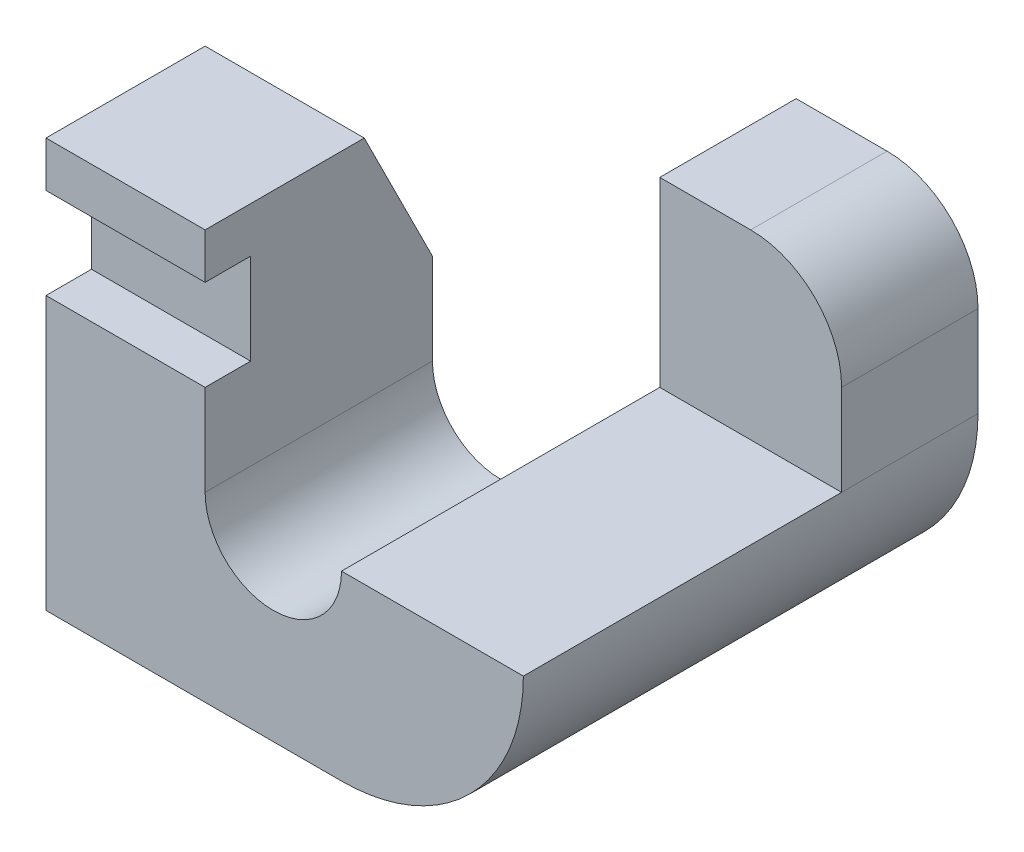
ISO-10303-21;
HEADER;
FILE_DESCRIPTION(('STEP AP214'),'2;1');
FILE_NAME('part.step','',(''),(''),'','','');
FILE_SCHEMA(('AUTOMOTIVE_DESIGN { 1 0 10303 214 1 1 1 1 }'));
ENDSEC;
DATA;
#1=APPLICATION_CONTEXT('core data for automotive mechanical design processes');
#2=APPLICATION_PROTOCOL_DEFINITION('international standard','automotive_design',2000,#1);
#3=PRODUCT_CONTEXT('',#1,'mechanical');
#4=PRODUCT('Part','Part','',(#3));
#5=PRODUCT_RELATED_PRODUCT_CATEGORY('part','',(#4));
#6=PRODUCT_DEFINITION_FORMATION('','',#4);
#7=PRODUCT_DEFINITION_CONTEXT('part definition',#1,'design');
#8=PRODUCT_DEFINITION('design','',#6,#7);
#9=PRODUCT_DEFINITION_SHAPE('','',#8);
#10=(LENGTH_UNIT() NAMED_UNIT(*) SI_UNIT(.MILLI.,.METRE.));
#11=(NAMED_UNIT(*) PLANE_ANGLE_UNIT() SI_UNIT($,.RADIAN.));
#12=(NAMED_UNIT(*) SI_UNIT($,.STERADIAN.) SOLID_ANGLE_UNIT());
#13=UNCERTAINTY_MEASURE_WITH_UNIT(LENGTH_MEASURE(1.E-05),#10,'distance_accuracy_value','');
#14=(GEOMETRIC_REPRESENTATION_CONTEXT(3) GLOBAL_UNCERTAINTY_ASSIGNED_CONTEXT((#13)) GLOBAL_UNIT_ASSIGNED_CONTEXT((#10,
#11,#12)) REPRESENTATION_CONTEXT('',''));
#15=CARTESIAN_POINT('',(0.,0.,0.));
#16=DIRECTION('',(0.,0.,1.));
#17=DIRECTION('',(1.,0.,0.));
#18=AXIS2_PLACEMENT_3D('',#15,#16,#17);
#19=CARTESIAN_POINT('',(-12.0347777082568,-10.3653005489695,80.));
#20=DIRECTION('',(0.,0.,1.));
#21=DIRECTION('',(1.,0.,0.));
#22=AXIS2_PLACEMENT_3D('',#19,#20,#21);
#23=PLANE('',#22);
#24=DIRECTION('',(-1.,0.,0.));
#25=VECTOR('',#24,1.);
#26=CARTESIAN_POINT('',(-12.0347777082568,21.6346994510305,80.));
#27=LINE('',#26,#25);
#28=CARTESIAN_POINT('',(-36.0347777082568,21.6346994510305,80.));
#29=VERTEX_POINT('',#28);
#30=CARTESIAN_POINT('',(-64.0347777082568,21.6346994510305,80.));
#31=VERTEX_POINT('',#30);
#32=EDGE_CURVE('E44',#29,#31,#27,.T.);
#33=ORIENTED_EDGE('',*,*,#32,.F.);
#34=DIRECTION('',(0.,1.,0.));
#35=VECTOR('',#34,1.);
#36=CARTESIAN_POINT('',(-36.0347777082568,29.6346994510305,80.));
#37=LINE('',#36,#35);
#38=CARTESIAN_POINT('',(-36.0347777082568,29.6346994510305,80.));
#39=VERTEX_POINT('',#38);
#40=EDGE_CURVE('E175',#29,#39,#37,.T.);
#41=ORIENTED_EDGE('',*,*,#40,.T.);
#42=DIRECTION('',(-1.,0.,0.));
#43=VECTOR('',#42,1.);
#44=CARTESIAN_POINT('',(-64.0347777082568,29.6346994510305,80.));
#45=LINE('',#44,#43);
#46=CARTESIAN_POINT('',(-64.0347777082568,29.6346994510305,80.));
#47=VERTEX_POINT('',#46);
#48=EDGE_CURVE('E174',#39,#47,#45,.T.);
#49=ORIENTED_EDGE('',*,*,#48,.T.);
#50=DIRECTION('',(0.,-1.,0.));
#51=VECTOR('',#50,1.);
#52=CARTESIAN_POINT('',(-64.0347777082568,29.6346994510305,80.));
#53=LINE('',#52,#51);
#54=EDGE_CURVE('E238',#47,#31,#53,.T.);
#55=ORIENTED_EDGE('',*,*,#54,.T.);
#56=EDGE_LOOP('',(#33,#41,#49,#55));
#57=FACE_BOUND('',#56,.T.);
#58=ADVANCED_FACE('F36',(#57),#23,.T.);
#59=CARTESIAN_POINT('',(-64.0347777082568,29.6346994510305,80.));
#60=DIRECTION('',(1.,0.,0.));
#61=DIRECTION('',(0.,1.,0.));
#62=AXIS2_PLACEMENT_3D('',#59,#60,#61);
#63=PLANE('',#62);
#64=DIRECTION('',(0.,1.,0.));
#65=VECTOR('',#64,1.);
#66=CARTESIAN_POINT('',(-64.0347777082568,29.6346994510305,72.));
#67=LINE('',#66,#65);
#68=CARTESIAN_POINT('',(-64.0347777082568,5.63469945103048,72.));
#69=VERTEX_POINT('',#68);
#70=CARTESIAN_POINT('',(-64.0347777082568,21.6346994510305,72.));
#71=VERTEX_POINT('',#70);
#72=EDGE_CURVE('E239',#69,#71,#67,.T.);
#73=ORIENTED_EDGE('',*,*,#72,.T.);
#74=DIRECTION('',(0.,0.,1.));
#75=VECTOR('',#74,1.);
#76=CARTESIAN_POINT('',(-64.0347777082568,21.6346994510305,80.));
#77=LINE('',#76,#75);
#78=EDGE_CURVE('E230',#71,#31,#77,.T.);
#79=ORIENTED_EDGE('',*,*,#78,.T.);
#80=ORIENTED_EDGE('',*,*,#54,.F.);
#81=DIRECTION('',(0.,0.,-1.));
#82=VECTOR('',#81,1.);
#83=CARTESIAN_POINT('',(-64.0347777082568,29.6346994510305,80.));
#84=LINE('',#83,#82);
#85=CARTESIAN_POINT('',(-64.0347777082568,29.6346994510305,52.));
#86=VERTEX_POINT('',#85);
#87=EDGE_CURVE('E177',#47,#86,#84,.T.);
#88=ORIENTED_EDGE('',*,*,#87,.T.);
#89=DIRECTION('',(0.,-0.894427190999916,-0.447213595499958));
#90=VECTOR('',#89,1.);
#91=CARTESIAN_POINT('',(-64.0347777082568,40.8346994510305,57.6));
#92=LINE('',#91,#90);
#93=CARTESIAN_POINT('',(-64.0347777082568,5.63469945103048,40.));
#94=VERTEX_POINT('',#93);
#95=EDGE_CURVE('E322',#86,#94,#92,.T.);
#96=ORIENTED_EDGE('',*,*,#95,.T.);
#97=DIRECTION('',(0.,1.,0.));
#98=VECTOR('',#97,1.);
#99=CARTESIAN_POINT('',(-64.0347777082568,-70.3653005489695,40.));
#100=LINE('',#99,#98);
#101=CARTESIAN_POINT('',(-64.0347777082568,-42.3653005489695,40.));
#102=VERTEX_POINT('',#101);
#103=EDGE_CURVE('E307',#102,#94,#100,.T.);
#104=ORIENTED_EDGE('',*,*,#103,.F.);
#105=DIRECTION('',(0.,0.,-1.));
#106=VECTOR('',#105,1.);
#107=CARTESIAN_POINT('',(-64.0347777082568,-42.3653005489695,80.));
#108=LINE('',#107,#106);
#109=CARTESIAN_POINT('',(-64.0347777082568,-42.3653005489695,80.));
#110=VERTEX_POINT('',#109);
#111=EDGE_CURVE('E222',#110,#102,#108,.T.);
#112=ORIENTED_EDGE('',*,*,#111,.F.);
#113=CARTESIAN_POINT('',(-64.0347777082568,5.63469945103048,80.));
#114=VERTEX_POINT('',#113);
#115=EDGE_CURVE('E197',#114,#110,#53,.T.);
#116=ORIENTED_EDGE('',*,*,#115,.F.);
#117=DIRECTION('',(0.,0.,-1.));
#118=VECTOR('',#117,1.);
#119=CARTESIAN_POINT('',(-64.0347777082568,5.63469945103048,80.));
#120=LINE('',#119,#118);
#121=EDGE_CURVE('E51',#114,#69,#120,.T.);
#122=ORIENTED_EDGE('',*,*,#121,.T.);
#123=EDGE_LOOP('',(#73,#79,#80,#88,#96,#104,#112,#116,#122));
#124=FACE_BOUND('',#123,.T.);
#125=ADVANCED_FACE('F38',(#124),#63,.F.);
#126=CARTESIAN_POINT('',(-64.0347777082568,-42.3653005489695,80.));
#127=DIRECTION('',(0.,1.,0.));
#128=DIRECTION('',(0.,0.,1.));
#129=AXIS2_PLACEMENT_3D('',#126,#127,#128);
#130=PLANE('',#129);
#131=ORIENTED_EDGE('',*,*,#111,.T.);
#132=DIRECTION('',(1.,0.,0.));
#133=VECTOR('',#132,1.);
#134=CARTESIAN_POINT('',(-64.0347777082568,-42.3653005489695,40.));
#135=LINE('',#134,#133);
#136=CARTESIAN_POINT('',(-12.0347777082568,-42.3653005489695,40.));
#137=VERTEX_POINT('',#136);
#138=EDGE_CURVE('E272',#102,#137,#135,.T.);
#139=ORIENTED_EDGE('',*,*,#138,.T.);
#140=DIRECTION('',(0.,0.,-1.));
#141=VECTOR('',#140,1.);
#142=CARTESIAN_POINT('',(-12.0347777082568,-42.3653005489695,80.));
#143=LINE('',#142,#141);
#144=CARTESIAN_POINT('',(-12.0347777082568,-42.3653005489695,80.));
#145=VERTEX_POINT('',#144);
#146=EDGE_CURVE('E219',#145,#137,#143,.T.);
#147=ORIENTED_EDGE('',*,*,#146,.F.);
#148=DIRECTION('',(1.,0.,0.));
#149=VECTOR('',#148,1.);
#150=CARTESIAN_POINT('',(-64.0347777082568,-42.3653005489695,80.));
#151=LINE('',#150,#149);
#152=EDGE_CURVE('E243',#110,#145,#151,.T.);
#153=ORIENTED_EDGE('',*,*,#152,.F.);
#154=EDGE_LOOP('',(#131,#139,#147,#153));
#155=FACE_BOUND('',#154,.T.);
#156=ADVANCED_FACE('F351',(#155),#130,.F.);
#157=CARTESIAN_POINT('',(-12.0347777082568,-10.3653005489695,80.));
#158=DIRECTION('',(0.,0.,-1.));
#159=DIRECTION('',(-1.,0.,0.));
#160=AXIS2_PLACEMENT_3D('',#157,#158,#159);
#161=CYLINDRICAL_SURFACE('',#160,32.);
#162=CARTESIAN_POINT('',(-12.0347777082568,-10.3653005489695,0.));
#163=DIRECTION('',(0.,0.,1.));
#164=DIRECTION('',(1.,0.,0.));
#165=AXIS2_PLACEMENT_3D('',#162,#163,#164);
#166=CIRCLE('',#165,32.);
#167=CARTESIAN_POINT('',(-12.0347777082568,-42.3653005489695,0.));
#168=VERTEX_POINT('',#167);
#169=CARTESIAN_POINT('',(19.9652222917432,-10.3653005489695,0.));
#170=VERTEX_POINT('',#169);
#171=EDGE_CURVE('E182',#168,#170,#166,.T.);
#172=ORIENTED_EDGE('',*,*,#171,.T.);
#173=DIRECTION('',(0.,0.,-1.));
#174=VECTOR('',#173,1.);
#175=CARTESIAN_POINT('',(19.9652222917432,-10.3653005489695,80.));
#176=LINE('',#175,#174);
#177=CARTESIAN_POINT('',(19.9652222917432,-10.3653005489695,24.));
#178=VERTEX_POINT('',#177);
#179=EDGE_CURVE('E215',#178,#170,#176,.T.);
#180=ORIENTED_EDGE('',*,*,#179,.F.);
#181=CARTESIAN_POINT('',(19.9652222917432,-10.3653005489695,80.));
#182=VERTEX_POINT('',#181);
#183=EDGE_CURVE('E216',#182,#178,#176,.T.);
#184=ORIENTED_EDGE('',*,*,#183,.F.);
#185=CARTESIAN_POINT('',(-12.0347777082568,-10.3653005489695,80.));
#186=DIRECTION('',(0.,0.,1.));
#187=DIRECTION('',(1.,0.,0.));
#188=AXIS2_PLACEMENT_3D('',#185,#186,#187);
#189=CIRCLE('',#188,32.);
#190=EDGE_CURVE('E245',#145,#182,#189,.T.);
#191=ORIENTED_EDGE('',*,*,#190,.F.);
#192=ORIENTED_EDGE('',*,*,#146,.T.);
#193=DIRECTION('',(0.,0.,-1.));
#194=VECTOR('',#193,1.);
#195=CARTESIAN_POINT('',(-12.0347777082568,-42.3653005489695,80.));
#196=LINE('',#195,#194);
#197=EDGE_CURVE('E300',#137,#168,#196,.T.);
#198=ORIENTED_EDGE('',*,*,#197,.T.);
#199=EDGE_LOOP('',(#172,#180,#184,#191,#192,#198));
#200=FACE_BOUND('',#199,.T.);
#201=ADVANCED_FACE('F257',(#200),#161,.T.);
#202=CARTESIAN_POINT('',(19.9652222917432,-10.3653005489695,80.));
#203=DIRECTION('',(-1.,0.,0.));
#204=DIRECTION('',(0.,0.,1.));
#205=AXIS2_PLACEMENT_3D('',#202,#203,#204);
#206=PLANE('',#205);
#207=DIRECTION('',(0.,0.,-1.));
#208=VECTOR('',#207,1.);
#209=CARTESIAN_POINT('',(19.9652222917432,5.63469945103048,80.));
#210=LINE('',#209,#208);
#211=CARTESIAN_POINT('',(19.9652222917432,5.63469945103048,24.));
#212=VERTEX_POINT('',#211);
#213=CARTESIAN_POINT('',(19.9652222917432,5.63469945103048,0.));
#214=VERTEX_POINT('',#213);
#215=EDGE_CURVE('E213',#212,#214,#210,.T.);
#216=ORIENTED_EDGE('',*,*,#215,.F.);
#217=DIRECTION('',(0.,1.,0.));
#218=VECTOR('',#217,1.);
#219=CARTESIAN_POINT('',(19.9652222917432,-10.3653005489695,24.));
#220=LINE('',#219,#218);
#221=EDGE_CURVE('E267',#178,#212,#220,.T.);
#222=ORIENTED_EDGE('',*,*,#221,.F.);
#223=ORIENTED_EDGE('',*,*,#179,.T.);
#224=DIRECTION('',(0.,1.,0.));
#225=VECTOR('',#224,1.);
#226=CARTESIAN_POINT('',(19.9652222917432,-10.3653005489695,0.));
#227=LINE('',#226,#225);
#228=EDGE_CURVE('E185',#170,#214,#227,.T.);
#229=ORIENTED_EDGE('',*,*,#228,.T.);
#230=EDGE_LOOP('',(#216,#222,#223,#229));
#231=FACE_BOUND('',#230,.T.);
#232=ADVANCED_FACE('F268',(#231),#206,.F.);
#233=CARTESIAN_POINT('',(3.96522229174322,5.63469945103048,80.));
#234=DIRECTION('',(0.,0.,-1.));
#235=DIRECTION('',(-1.,0.,0.));
#236=AXIS2_PLACEMENT_3D('',#233,#234,#235);
#237=CYLINDRICAL_SURFACE('',#236,16.);
#238=DIRECTION('',(0.,0.,-1.));
#239=VECTOR('',#238,1.);
#240=CARTESIAN_POINT('',(3.96522229174322,21.6346994510305,80.));
#241=LINE('',#240,#239);
#242=CARTESIAN_POINT('',(3.96522229174322,21.6346994510305,24.));
#243=VERTEX_POINT('',#242);
#244=CARTESIAN_POINT('',(3.96522229174322,21.6346994510305,0.));
#245=VERTEX_POINT('',#244);
#246=EDGE_CURVE('E211',#243,#245,#241,.T.);
#247=ORIENTED_EDGE('',*,*,#246,.F.);
#248=CARTESIAN_POINT('',(3.96522229174322,5.63469945103048,24.));
#249=DIRECTION('',(0.,0.,-1.));
#250=DIRECTION('',(-1.,0.,0.));
#251=AXIS2_PLACEMENT_3D('',#248,#249,#250);
#252=CIRCLE('',#251,16.);
#253=EDGE_CURVE('E186',#243,#212,#252,.T.);
#254=ORIENTED_EDGE('',*,*,#253,.T.);
#255=ORIENTED_EDGE('',*,*,#215,.T.);
#256=CARTESIAN_POINT('',(3.96522229174322,5.63469945103048,0.));
#257=DIRECTION('',(0.,0.,1.));
#258=DIRECTION('',(-1.,0.,0.));
#259=AXIS2_PLACEMENT_3D('',#256,#257,#258);
#260=CIRCLE('',#259,16.);
#261=EDGE_CURVE('E189',#214,#245,#260,.T.);
#262=ORIENTED_EDGE('',*,*,#261,.T.);
#263=EDGE_LOOP('',(#247,#254,#255,#262));
#264=FACE_BOUND('',#263,.T.);
#265=ADVANCED_FACE('F287',(#264),#237,.T.);
#266=CARTESIAN_POINT('',(-12.0347777082568,21.6346994510305,80.));
#267=DIRECTION('',(0.,-1.,0.));
#268=DIRECTION('',(0.,0.,-1.));
#269=AXIS2_PLACEMENT_3D('',#266,#267,#268);
#270=PLANE('',#269);
#271=DIRECTION('',(0.,0.,-1.));
#272=VECTOR('',#271,1.);
#273=CARTESIAN_POINT('',(-12.0347777082568,21.6346994510305,80.));
#274=LINE('',#273,#272);
#275=CARTESIAN_POINT('',(-12.0347777082568,21.6346994510305,24.));
#276=VERTEX_POINT('',#275);
#277=CARTESIAN_POINT('',(-12.0347777082568,21.6346994510305,0.));
#278=VERTEX_POINT('',#277);
#279=EDGE_CURVE('E209',#276,#278,#274,.T.);
#280=ORIENTED_EDGE('',*,*,#279,.F.);
#281=DIRECTION('',(1.,0.,0.));
#282=VECTOR('',#281,1.);
#283=CARTESIAN_POINT('',(-12.0347777082568,21.6346994510305,24.));
#284=LINE('',#283,#282);
#285=EDGE_CURVE('E281',#276,#243,#284,.T.);
#286=ORIENTED_EDGE('',*,*,#285,.T.);
#287=ORIENTED_EDGE('',*,*,#246,.T.);
#288=DIRECTION('',(-1.,0.,0.));
#289=VECTOR('',#288,1.);
#290=CARTESIAN_POINT('',(-12.0347777082568,21.6346994510305,0.));
#291=LINE('',#290,#289);
#292=EDGE_CURVE('E192',#245,#278,#291,.T.);
#293=ORIENTED_EDGE('',*,*,#292,.T.);
#294=EDGE_LOOP('',(#280,#286,#287,#293));
#295=FACE_BOUND('',#294,.T.);
#296=ADVANCED_FACE('F291',(#295),#270,.F.);
#297=CARTESIAN_POINT('',(-12.0347777082568,-10.3653005489695,80.));
#298=DIRECTION('',(1.,0.,0.));
#299=DIRECTION('',(0.,0.,-1.));
#300=AXIS2_PLACEMENT_3D('',#297,#298,#299);
#301=PLANE('',#300);
#302=DIRECTION('',(0.,-1.,0.));
#303=VECTOR('',#302,1.);
#304=CARTESIAN_POINT('',(-12.0347777082568,-10.3653005489695,0.));
#305=LINE('',#304,#303);
#306=EDGE_CURVE('E195',#278,#168,#305,.T.);
#307=ORIENTED_EDGE('',*,*,#306,.T.);
#308=ORIENTED_EDGE('',*,*,#197,.F.);
#309=DIRECTION('',(0.,1.,0.));
#310=VECTOR('',#309,1.);
#311=CARTESIAN_POINT('',(-12.0347777082568,-70.3653005489695,40.));
#312=LINE('',#311,#310);
#313=CARTESIAN_POINT('',(-12.0347777082568,-10.3653005489695,40.));
#314=VERTEX_POINT('',#313);
#315=EDGE_CURVE('E303',#137,#314,#312,.T.);
#316=ORIENTED_EDGE('',*,*,#315,.T.);
#317=DIRECTION('',(0.,0.,-1.));
#318=VECTOR('',#317,1.);
#319=CARTESIAN_POINT('',(-12.0347777082568,-10.3653005489695,80.));
#320=LINE('',#319,#318);
#321=CARTESIAN_POINT('',(-12.0347777082568,-10.3653005489695,24.));
#322=VERTEX_POINT('',#321);
#323=EDGE_CURVE('E205',#314,#322,#320,.T.);
#324=ORIENTED_EDGE('',*,*,#323,.T.);
#325=DIRECTION('',(0.,1.,0.));
#326=VECTOR('',#325,1.);
#327=CARTESIAN_POINT('',(-12.0347777082568,-10.3653005489695,24.));
#328=LINE('',#327,#326);
#329=EDGE_CURVE('E271',#322,#276,#328,.T.);
#330=ORIENTED_EDGE('',*,*,#329,.T.);
#331=ORIENTED_EDGE('',*,*,#279,.T.);
#332=EDGE_LOOP('',(#307,#308,#316,#324,#330,#331));
#333=FACE_BOUND('',#332,.T.);
#334=ADVANCED_FACE('F290',(#333),#301,.F.);
#335=CARTESIAN_POINT('',(-24.0347777082568,-10.3653005489695,80.));
#336=DIRECTION('',(0.,0.,-1.));
#337=DIRECTION('',(-1.,0.,0.));
#338=AXIS2_PLACEMENT_3D('',#335,#336,#337);
#339=CYLINDRICAL_SURFACE('',#338,12.);
#340=CARTESIAN_POINT('',(-12.0347777082568,-10.3653005489695,80.));
#341=VERTEX_POINT('',#340);
#342=EDGE_CURVE('E206',#341,#314,#320,.T.);
#343=ORIENTED_EDGE('',*,*,#342,.T.);
#344=CARTESIAN_POINT('',(-24.0347777082568,-10.3653005489695,40.));
#345=DIRECTION('',(0.,0.,1.));
#346=DIRECTION('',(1.,0.,0.));
#347=AXIS2_PLACEMENT_3D('',#344,#345,#346);
#348=CIRCLE('',#347,12.);
#349=CARTESIAN_POINT('',(-36.0347777082568,-10.3653005489695,40.));
#350=VERTEX_POINT('',#349);
#351=EDGE_CURVE('E277',#314,#350,#348,.F.);
#352=ORIENTED_EDGE('',*,*,#351,.T.);
#353=DIRECTION('',(0.,0.,-1.));
#354=VECTOR('',#353,1.);
#355=CARTESIAN_POINT('',(-36.0347777082568,-10.3653005489695,80.));
#356=LINE('',#355,#354);
#357=CARTESIAN_POINT('',(-36.0347777082568,-10.3653005489695,80.));
#358=VERTEX_POINT('',#357);
#359=EDGE_CURVE('E203',#358,#350,#356,.T.);
#360=ORIENTED_EDGE('',*,*,#359,.F.);
#361=CARTESIAN_POINT('',(-24.0347777082568,-10.3653005489695,80.));
#362=DIRECTION('',(0.,0.,-1.));
#363=DIRECTION('',(1.,0.,0.));
#364=AXIS2_PLACEMENT_3D('',#361,#362,#363);
#365=CIRCLE('',#364,12.);
#366=EDGE_CURVE('E172',#341,#358,#365,.T.);
#367=ORIENTED_EDGE('',*,*,#366,.F.);
#368=EDGE_LOOP('',(#343,#352,#360,#367));
#369=FACE_BOUND('',#368,.T.);
#370=ADVANCED_FACE('F314',(#369),#339,.F.);
#371=CARTESIAN_POINT('',(-36.0347777082568,29.6346994510305,80.));
#372=DIRECTION('',(-1.,0.,0.));
#373=DIRECTION('',(0.,0.,1.));
#374=AXIS2_PLACEMENT_3D('',#371,#372,#373);
#375=PLANE('',#374);
#376=ORIENTED_EDGE('',*,*,#40,.F.);
#377=DIRECTION('',(0.,0.,-1.));
#378=VECTOR('',#377,1.);
#379=CARTESIAN_POINT('',(-36.0347777082568,21.6346994510305,80.));
#380=LINE('',#379,#378);
#381=CARTESIAN_POINT('',(-36.0347777082568,21.6346994510305,72.));
#382=VERTEX_POINT('',#381);
#383=EDGE_CURVE('E232',#29,#382,#380,.T.);
#384=ORIENTED_EDGE('',*,*,#383,.T.);
#385=DIRECTION('',(0.,-1.,0.));
#386=VECTOR('',#385,1.);
#387=CARTESIAN_POINT('',(-36.0347777082568,29.6346994510305,72.));
#388=LINE('',#387,#386);
#389=CARTESIAN_POINT('',(-36.0347777082568,5.63469945103048,72.));
#390=VERTEX_POINT('',#389);
#391=EDGE_CURVE('E11',#382,#390,#388,.T.);
#392=ORIENTED_EDGE('',*,*,#391,.T.);
#393=DIRECTION('',(0.,0.,1.));
#394=VECTOR('',#393,1.);
#395=CARTESIAN_POINT('',(-36.0347777082568,5.63469945103048,80.));
#396=LINE('',#395,#394);
#397=CARTESIAN_POINT('',(-36.0347777082568,5.63469945103048,80.));
#398=VERTEX_POINT('',#397);
#399=EDGE_CURVE('E153',#390,#398,#396,.T.);
#400=ORIENTED_EDGE('',*,*,#399,.T.);
#401=EDGE_CURVE('E165',#358,#398,#37,.T.);
#402=ORIENTED_EDGE('',*,*,#401,.F.);
#403=ORIENTED_EDGE('',*,*,#359,.T.);
#404=DIRECTION('',(0.,1.,0.));
#405=VECTOR('',#404,1.);
#406=CARTESIAN_POINT('',(-36.0347777082568,29.6346994510305,40.));
#407=LINE('',#406,#405);
#408=CARTESIAN_POINT('',(-36.0347777082568,5.63469945103048,40.));
#409=VERTEX_POINT('',#408);
#410=EDGE_CURVE('E302',#350,#409,#407,.T.);
#411=ORIENTED_EDGE('',*,*,#410,.T.);
#412=DIRECTION('',(0.,-0.894427190999916,-0.447213595499958));
#413=VECTOR('',#412,1.);
#414=CARTESIAN_POINT('',(-36.0347777082568,5.63469945103048,40.));
#415=LINE('',#414,#413);
#416=CARTESIAN_POINT('',(-36.0347777082568,29.6346994510305,52.));
#417=VERTEX_POINT('',#416);
#418=EDGE_CURVE('E59',#417,#409,#415,.T.);
#419=ORIENTED_EDGE('',*,*,#418,.F.);
#420=DIRECTION('',(0.,0.,-1.));
#421=VECTOR('',#420,1.);
#422=CARTESIAN_POINT('',(-36.0347777082568,29.6346994510305,80.));
#423=LINE('',#422,#421);
#424=EDGE_CURVE('E200',#39,#417,#423,.T.);
#425=ORIENTED_EDGE('',*,*,#424,.F.);
#426=EDGE_LOOP('',(#376,#384,#392,#400,#402,#403,#411,#419,#425));
#427=FACE_BOUND('',#426,.T.);
#428=ADVANCED_FACE('F163',(#427),#375,.F.);
#429=CARTESIAN_POINT('',(-64.0347777082568,29.6346994510305,80.));
#430=DIRECTION('',(0.,-1.,0.));
#431=DIRECTION('',(0.,0.,-1.));
#432=AXIS2_PLACEMENT_3D('',#429,#430,#431);
#433=PLANE('',#432);
#434=ORIENTED_EDGE('',*,*,#424,.T.);
#435=DIRECTION('',(1.,0.,0.));
#436=VECTOR('',#435,1.);
#437=CARTESIAN_POINT('',(-136.034777708257,29.6346994510305,52.));
#438=LINE('',#437,#436);
#439=EDGE_CURVE('E325',#86,#417,#438,.T.);
#440=ORIENTED_EDGE('',*,*,#439,.F.);
#441=ORIENTED_EDGE('',*,*,#87,.F.);
#442=ORIENTED_EDGE('',*,*,#48,.F.);
#443=EDGE_LOOP('',(#434,#440,#441,#442));
#444=FACE_BOUND('',#443,.T.);
#445=ADVANCED_FACE('F337',(#444),#433,.F.);
#446=DIRECTION('',(1.,0.,0.));
#447=VECTOR('',#446,1.);
#448=CARTESIAN_POINT('',(-12.0347777082568,5.63469945103048,80.));
#449=LINE('',#448,#447);
#450=EDGE_CURVE('E150',#114,#398,#449,.T.);
#451=ORIENTED_EDGE('',*,*,#450,.F.);
#452=ORIENTED_EDGE('',*,*,#115,.T.);
#453=ORIENTED_EDGE('',*,*,#152,.T.);
#454=ORIENTED_EDGE('',*,*,#190,.T.);
#455=DIRECTION('',(1.,0.,0.));
#456=VECTOR('',#455,1.);
#457=CARTESIAN_POINT('',(-12.0347777082568,-10.3653005489695,80.));
#458=LINE('',#457,#456);
#459=EDGE_CURVE('E252',#341,#182,#458,.T.);
#460=ORIENTED_EDGE('',*,*,#459,.F.);
#461=ORIENTED_EDGE('',*,*,#366,.T.);
#462=ORIENTED_EDGE('',*,*,#401,.T.);
#463=EDGE_LOOP('',(#451,#452,#453,#454,#460,#461,#462));
#464=FACE_BOUND('',#463,.T.);
#465=ADVANCED_FACE('F169',(#464),#23,.T.);
#466=CARTESIAN_POINT('',(-12.0347777082568,-10.3653005489695,0.));
#467=DIRECTION('',(0.,0.,1.));
#468=DIRECTION('',(1.,0.,0.));
#469=AXIS2_PLACEMENT_3D('',#466,#467,#468);
#470=PLANE('',#469);
#471=ORIENTED_EDGE('',*,*,#171,.F.);
#472=ORIENTED_EDGE('',*,*,#306,.F.);
#473=ORIENTED_EDGE('',*,*,#292,.F.);
#474=ORIENTED_EDGE('',*,*,#261,.F.);
#475=ORIENTED_EDGE('',*,*,#228,.F.);
#476=EDGE_LOOP('',(#471,#472,#473,#474,#475));
#477=FACE_BOUND('',#476,.T.);
#478=ADVANCED_FACE('F297',(#477),#470,.F.);
#479=CARTESIAN_POINT('',(-12.0347777082568,-10.3653005489695,24.));
#480=DIRECTION('',(0.,0.,-1.));
#481=DIRECTION('',(-1.,0.,0.));
#482=AXIS2_PLACEMENT_3D('',#479,#480,#481);
#483=PLANE('',#482);
#484=ORIENTED_EDGE('',*,*,#285,.F.);
#485=ORIENTED_EDGE('',*,*,#329,.F.);
#486=DIRECTION('',(1.,0.,0.));
#487=VECTOR('',#486,1.);
#488=CARTESIAN_POINT('',(-12.0347777082568,-10.3653005489695,24.));
#489=LINE('',#488,#487);
#490=EDGE_CURVE('E263',#322,#178,#489,.T.);
#491=ORIENTED_EDGE('',*,*,#490,.T.);
#492=ORIENTED_EDGE('',*,*,#221,.T.);
#493=ORIENTED_EDGE('',*,*,#253,.F.);
#494=EDGE_LOOP('',(#484,#485,#491,#492,#493));
#495=FACE_BOUND('',#494,.T.);
#496=ADVANCED_FACE('F288',(#495),#483,.F.);
#497=CARTESIAN_POINT('',(-12.0347777082568,-10.3653005489695,80.));
#498=DIRECTION('',(0.,-1.,0.));
#499=DIRECTION('',(0.,0.,-1.));
#500=AXIS2_PLACEMENT_3D('',#497,#498,#499);
#501=PLANE('',#500);
#502=ORIENTED_EDGE('',*,*,#183,.T.);
#503=ORIENTED_EDGE('',*,*,#490,.F.);
#504=ORIENTED_EDGE('',*,*,#323,.F.);
#505=ORIENTED_EDGE('',*,*,#342,.F.);
#506=ORIENTED_EDGE('',*,*,#459,.T.);
#507=EDGE_LOOP('',(#502,#503,#504,#505,#506));
#508=FACE_BOUND('',#507,.T.);
#509=ADVANCED_FACE('F261',(#508),#501,.F.);
#510=CARTESIAN_POINT('',(-12.0347777082568,-70.3653005489695,40.));
#511=DIRECTION('',(0.,0.,1.));
#512=DIRECTION('',(1.,0.,0.));
#513=AXIS2_PLACEMENT_3D('',#510,#511,#512);
#514=PLANE('',#513);
#515=ORIENTED_EDGE('',*,*,#103,.T.);
#516=DIRECTION('',(1.,0.,0.));
#517=VECTOR('',#516,1.);
#518=CARTESIAN_POINT('',(-12.0347777082568,5.63469945103047,40.));
#519=LINE('',#518,#517);
#520=EDGE_CURVE('E158',#94,#409,#519,.T.);
#521=ORIENTED_EDGE('',*,*,#520,.T.);
#522=ORIENTED_EDGE('',*,*,#410,.F.);
#523=ORIENTED_EDGE('',*,*,#351,.F.);
#524=ORIENTED_EDGE('',*,*,#315,.F.);
#525=ORIENTED_EDGE('',*,*,#138,.F.);
#526=EDGE_LOOP('',(#515,#521,#522,#523,#524,#525));
#527=FACE_BOUND('',#526,.T.);
#528=ADVANCED_FACE('F318',(#527),#514,.F.);
#529=CARTESIAN_POINT('',(-136.034777708257,5.63469945103048,40.));
#530=DIRECTION('',(0.,-0.447213595499958,0.894427190999916));
#531=DIRECTION('',(0.,-0.894427190999916,-0.447213595499958));
#532=AXIS2_PLACEMENT_3D('',#529,#530,#531);
#533=PLANE('',#532);
#534=ORIENTED_EDGE('',*,*,#439,.T.);
#535=ORIENTED_EDGE('',*,*,#418,.T.);
#536=ORIENTED_EDGE('',*,*,#520,.F.);
#537=ORIENTED_EDGE('',*,*,#95,.F.);
#538=EDGE_LOOP('',(#534,#535,#536,#537));
#539=FACE_BOUND('',#538,.T.);
#540=ADVANCED_FACE('F321',(#539),#533,.F.);
#541=CARTESIAN_POINT('',(-100.,21.6346994510305,72.));
#542=DIRECTION('',(0.,0.,-1.));
#543=DIRECTION('',(-1.,0.,0.));
#544=AXIS2_PLACEMENT_3D('',#541,#542,#543);
#545=PLANE('',#544);
#546=DIRECTION('',(1.,0.,0.));
#547=VECTOR('',#546,1.);
#548=CARTESIAN_POINT('',(-100.,5.63469945103048,72.));
#549=LINE('',#548,#547);
#550=EDGE_CURVE('E333',#69,#390,#549,.T.);
#551=ORIENTED_EDGE('',*,*,#550,.T.);
#552=ORIENTED_EDGE('',*,*,#391,.F.);
#553=DIRECTION('',(1.,0.,0.));
#554=VECTOR('',#553,1.);
#555=CARTESIAN_POINT('',(-100.,21.6346994510305,72.));
#556=LINE('',#555,#554);
#557=EDGE_CURVE('E167',#71,#382,#556,.T.);
#558=ORIENTED_EDGE('',*,*,#557,.F.);
#559=ORIENTED_EDGE('',*,*,#72,.F.);
#560=EDGE_LOOP('',(#551,#552,#558,#559));
#561=FACE_BOUND('',#560,.T.);
#562=ADVANCED_FACE('F366',(#561),#545,.F.);
#563=CARTESIAN_POINT('',(-100.,21.6346994510305,80.));
#564=DIRECTION('',(0.,1.,0.));
#565=DIRECTION('',(0.,0.,1.));
#566=AXIS2_PLACEMENT_3D('',#563,#564,#565);
#567=PLANE('',#566);
#568=ORIENTED_EDGE('',*,*,#557,.T.);
#569=ORIENTED_EDGE('',*,*,#383,.F.);
#570=ORIENTED_EDGE('',*,*,#32,.T.);
#571=ORIENTED_EDGE('',*,*,#78,.F.);
#572=EDGE_LOOP('',(#568,#569,#570,#571));
#573=FACE_BOUND('',#572,.T.);
#574=ADVANCED_FACE('F229',(#573),#567,.F.);
#575=CARTESIAN_POINT('',(-100.,5.63469945103048,72.));
#576=DIRECTION('',(0.,-1.,0.));
#577=DIRECTION('',(0.,0.,-1.));
#578=AXIS2_PLACEMENT_3D('',#575,#576,#577);
#579=PLANE('',#578);
#580=ORIENTED_EDGE('',*,*,#450,.T.);
#581=ORIENTED_EDGE('',*,*,#399,.F.);
#582=ORIENTED_EDGE('',*,*,#550,.F.);
#583=ORIENTED_EDGE('',*,*,#121,.F.);
#584=EDGE_LOOP('',(#580,#581,#582,#583));
#585=FACE_BOUND('',#584,.T.);
#586=ADVANCED_FACE('F152',(#585),#579,.F.);
#587=CLOSED_SHELL('',(#58,#125,#156,#201,#232,#265,#296,#334,#370,#428,#445,#465,#478,#496,#509,
#528,#540,#562,#574,#586));
#588=MANIFOLD_SOLID_BREP('B2',#587);
#589=ADVANCED_BREP_SHAPE_REPRESENTATION('',(#18,#588),#14);
#590=SHAPE_DEFINITION_REPRESENTATION(#9,#589);
ENDSEC;
END-ISO-10303-21;
